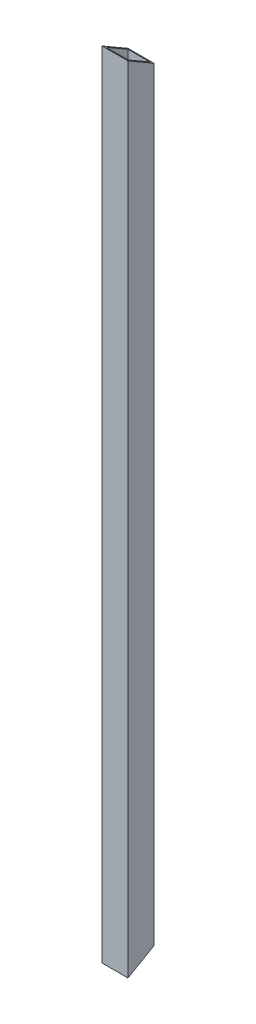
ISO-10303-21;
HEADER;
FILE_DESCRIPTION(('STEP AP214'),'2;1');
FILE_NAME('part.step','',(''),(''),'','','');
FILE_SCHEMA(('AUTOMOTIVE_DESIGN { 1 0 10303 214 1 1 1 1 }'));
ENDSEC;
DATA;
#1=APPLICATION_CONTEXT('core data for automotive mechanical design processes');
#2=APPLICATION_PROTOCOL_DEFINITION('international standard','automotive_design',2000,#1);
#3=PRODUCT_CONTEXT('',#1,'mechanical');
#4=PRODUCT('Part','Part','',(#3));
#5=PRODUCT_RELATED_PRODUCT_CATEGORY('part','',(#4));
#6=PRODUCT_DEFINITION_FORMATION('','',#4);
#7=PRODUCT_DEFINITION_CONTEXT('part definition',#1,'design');
#8=PRODUCT_DEFINITION('design','',#6,#7);
#9=PRODUCT_DEFINITION_SHAPE('','',#8);
#10=(LENGTH_UNIT() NAMED_UNIT(*) SI_UNIT(.MILLI.,.METRE.));
#11=(NAMED_UNIT(*) PLANE_ANGLE_UNIT() SI_UNIT($,.RADIAN.));
#12=(NAMED_UNIT(*) SI_UNIT($,.STERADIAN.) SOLID_ANGLE_UNIT());
#13=UNCERTAINTY_MEASURE_WITH_UNIT(LENGTH_MEASURE(1.E-05),#10,'distance_accuracy_value','');
#14=(GEOMETRIC_REPRESENTATION_CONTEXT(3) GLOBAL_UNCERTAINTY_ASSIGNED_CONTEXT((#13)) GLOBAL_UNIT_ASSIGNED_CONTEXT((#10,
#11,#12)) REPRESENTATION_CONTEXT('',''));
#15=CARTESIAN_POINT('',(0.,0.,0.));
#16=DIRECTION('',(0.,0.,1.));
#17=DIRECTION('',(1.,0.,0.));
#18=AXIS2_PLACEMENT_3D('',#15,#16,#17);
#19=CARTESIAN_POINT('',(-6.5,400.,-6.5));
#20=DIRECTION('',(1.,0.,0.));
#21=DIRECTION('',(0.,0.,-1.));
#22=AXIS2_PLACEMENT_3D('',#19,#20,#21);
#23=PLANE('',#22);
#24=DIRECTION('',(0.,0.499999999999995,-0.866025403784442));
#25=VECTOR('',#24,1.);
#26=CARTESIAN_POINT('',(-6.5,105.629165124597,-176.455080756887));
#27=LINE('',#26,#25);
#28=CARTESIAN_POINT('',(-6.5,0.,6.5));
#29=VERTEX_POINT('',#28);
#30=CARTESIAN_POINT('',(-6.5,7.50555349946508,-6.5));
#31=VERTEX_POINT('',#30);
#32=EDGE_CURVE('E121',#29,#31,#27,.T.);
#33=ORIENTED_EDGE('',*,*,#32,.F.);
#34=DIRECTION('',(0.,-1.,0.));
#35=VECTOR('',#34,1.);
#36=CARTESIAN_POINT('',(-6.5,400.,6.5));
#37=LINE('',#36,#35);
#38=CARTESIAN_POINT('',(-6.49999999999995,400.,6.5));
#39=VERTEX_POINT('',#38);
#40=EDGE_CURVE('E187',#39,#29,#37,.T.);
#41=ORIENTED_EDGE('',*,*,#40,.F.);
#42=DIRECTION('',(0.,-0.499999999999995,-0.866025403784442));
#43=VECTOR('',#42,1.);
#44=CARTESIAN_POINT('',(-6.5,394.370834875401,-3.25000000000007));
#45=LINE('',#44,#43);
#46=CARTESIAN_POINT('',(-6.49999999999995,392.494446500535,-6.5));
#47=VERTEX_POINT('',#46);
#48=EDGE_CURVE('E157',#39,#47,#45,.T.);
#49=ORIENTED_EDGE('',*,*,#48,.T.);
#50=DIRECTION('',(0.,-1.,0.));
#51=VECTOR('',#50,1.);
#52=CARTESIAN_POINT('',(-6.5,400.,-6.5));
#53=LINE('',#52,#51);
#54=EDGE_CURVE('E111',#47,#31,#53,.T.);
#55=ORIENTED_EDGE('',*,*,#54,.T.);
#56=EDGE_LOOP('',(#33,#41,#49,#55));
#57=FACE_BOUND('',#56,.T.);
#58=ADVANCED_FACE('F39',(#57),#23,.F.);
#59=CARTESIAN_POINT('',(6.5,400.,-6.5));
#60=DIRECTION('',(-1.,0.,0.));
#61=DIRECTION('',(0.,0.,1.));
#62=AXIS2_PLACEMENT_3D('',#59,#60,#61);
#63=PLANE('',#62);
#64=DIRECTION('',(0.,-0.499999999999994,0.866025403784442));
#65=VECTOR('',#64,1.);
#66=CARTESIAN_POINT('',(6.5,105.629165124597,-176.455080756887));
#67=LINE('',#66,#65);
#68=CARTESIAN_POINT('',(6.49999999999995,7.50555349946502,-6.5));
#69=VERTEX_POINT('',#68);
#70=CARTESIAN_POINT('',(6.5,0.,6.5));
#71=VERTEX_POINT('',#70);
#72=EDGE_CURVE('E115',#69,#71,#67,.T.);
#73=ORIENTED_EDGE('',*,*,#72,.F.);
#74=DIRECTION('',(0.,-1.,0.));
#75=VECTOR('',#74,1.);
#76=CARTESIAN_POINT('',(6.5,400.,-6.5));
#77=LINE('',#76,#75);
#78=CARTESIAN_POINT('',(6.5,392.494446500535,-6.5));
#79=VERTEX_POINT('',#78);
#80=EDGE_CURVE('E103',#79,#69,#77,.T.);
#81=ORIENTED_EDGE('',*,*,#80,.F.);
#82=DIRECTION('',(0.,0.499999999999994,0.866025403784442));
#83=VECTOR('',#82,1.);
#84=CARTESIAN_POINT('',(6.5,394.370834875401,-3.25000000000007));
#85=LINE('',#84,#83);
#86=CARTESIAN_POINT('',(6.49999999999995,400.,6.5));
#87=VERTEX_POINT('',#86);
#88=EDGE_CURVE('E154',#79,#87,#85,.T.);
#89=ORIENTED_EDGE('',*,*,#88,.T.);
#90=DIRECTION('',(0.,-1.,0.));
#91=VECTOR('',#90,1.);
#92=CARTESIAN_POINT('',(6.5,400.,6.5));
#93=LINE('',#92,#91);
#94=EDGE_CURVE('E110',#87,#71,#93,.T.);
#95=ORIENTED_EDGE('',*,*,#94,.T.);
#96=EDGE_LOOP('',(#73,#81,#89,#95));
#97=FACE_BOUND('',#96,.T.);
#98=ADVANCED_FACE('F116',(#97),#63,.F.);
#99=CARTESIAN_POINT('',(-6.5,400.,-6.5));
#100=DIRECTION('',(0.,0.,1.));
#101=DIRECTION('',(1.,0.,0.));
#102=AXIS2_PLACEMENT_3D('',#99,#100,#101);
#103=PLANE('',#102);
#104=DIRECTION('',(1.,0.,0.));
#105=VECTOR('',#104,1.);
#106=CARTESIAN_POINT('',(-507.027846378201,7.50555349946502,-6.5));
#107=LINE('',#106,#105);
#108=EDGE_CURVE('E54',#31,#69,#107,.T.);
#109=ORIENTED_EDGE('',*,*,#108,.F.);
#110=ORIENTED_EDGE('',*,*,#54,.F.);
#111=DIRECTION('',(1.,0.,0.));
#112=VECTOR('',#111,1.);
#113=CARTESIAN_POINT('',(-507.027846378201,392.494446500535,-6.5));
#114=LINE('',#113,#112);
#115=EDGE_CURVE('E106',#47,#79,#114,.T.);
#116=ORIENTED_EDGE('',*,*,#115,.T.);
#117=ORIENTED_EDGE('',*,*,#80,.T.);
#118=EDGE_LOOP('',(#109,#110,#116,#117));
#119=FACE_BOUND('',#118,.T.);
#120=ADVANCED_FACE('F105',(#119),#103,.F.);
#121=CARTESIAN_POINT('',(5.5,400.,-5.5));
#122=DIRECTION('',(-1.,0.,0.));
#123=DIRECTION('',(0.,0.,1.));
#124=AXIS2_PLACEMENT_3D('',#121,#122,#123);
#125=PLANE('',#124);
#126=DIRECTION('',(0.,-1.,0.));
#127=VECTOR('',#126,1.);
#128=CARTESIAN_POINT('',(5.5,400.,-5.5));
#129=LINE('',#128,#127);
#130=CARTESIAN_POINT('',(5.5,393.071796769725,-5.5));
#131=VERTEX_POINT('',#130);
#132=CARTESIAN_POINT('',(5.5,6.92820323027543,-5.5));
#133=VERTEX_POINT('',#132);
#134=EDGE_CURVE('E173',#131,#133,#129,.T.);
#135=ORIENTED_EDGE('',*,*,#134,.T.);
#136=DIRECTION('',(0.,-0.499999999999995,0.866025403784442));
#137=VECTOR('',#136,1.);
#138=CARTESIAN_POINT('',(5.49999999999997,105.196152422704,-175.705080756887));
#139=LINE('',#138,#137);
#140=CARTESIAN_POINT('',(5.5,0.577350269189647,5.5));
#141=VERTEX_POINT('',#140);
#142=EDGE_CURVE('E122',#133,#141,#139,.T.);
#143=ORIENTED_EDGE('',*,*,#142,.T.);
#144=DIRECTION('',(0.,-1.,0.));
#145=VECTOR('',#144,1.);
#146=CARTESIAN_POINT('',(5.5,400.,5.5));
#147=LINE('',#146,#145);
#148=CARTESIAN_POINT('',(5.5,399.42264973081,5.5));
#149=VERTEX_POINT('',#148);
#150=EDGE_CURVE('E161',#149,#141,#147,.T.);
#151=ORIENTED_EDGE('',*,*,#150,.F.);
#152=DIRECTION('',(0.,0.499999999999995,0.866025403784442));
#153=VECTOR('',#152,1.);
#154=CARTESIAN_POINT('',(5.5,394.803847577293,-2.50000000000007));
#155=LINE('',#154,#153);
#156=EDGE_CURVE('E150',#131,#149,#155,.T.);
#157=ORIENTED_EDGE('',*,*,#156,.F.);
#158=EDGE_LOOP('',(#135,#143,#151,#157));
#159=FACE_BOUND('',#158,.T.);
#160=ADVANCED_FACE('F200',(#159),#125,.T.);
#161=CARTESIAN_POINT('',(-5.5,400.,-5.5));
#162=DIRECTION('',(0.,0.,1.));
#163=DIRECTION('',(1.,0.,0.));
#164=AXIS2_PLACEMENT_3D('',#161,#162,#163);
#165=PLANE('',#164);
#166=DIRECTION('',(0.,-1.,0.));
#167=VECTOR('',#166,1.);
#168=CARTESIAN_POINT('',(-5.5,400.,-5.5));
#169=LINE('',#168,#167);
#170=CARTESIAN_POINT('',(-5.5,393.071796769725,-5.5));
#171=VERTEX_POINT('',#170);
#172=CARTESIAN_POINT('',(-5.5,6.92820323027539,-5.50000000000001));
#173=VERTEX_POINT('',#172);
#174=EDGE_CURVE('E169',#171,#173,#169,.T.);
#175=ORIENTED_EDGE('',*,*,#174,.T.);
#176=DIRECTION('',(1.,0.,0.));
#177=VECTOR('',#176,1.);
#178=CARTESIAN_POINT('',(-5.5,6.92820323027543,-5.5));
#179=LINE('',#178,#177);
#180=EDGE_CURVE('E129',#173,#133,#179,.T.);
#181=ORIENTED_EDGE('',*,*,#180,.T.);
#182=ORIENTED_EDGE('',*,*,#134,.F.);
#183=DIRECTION('',(1.,0.,0.));
#184=VECTOR('',#183,1.);
#185=CARTESIAN_POINT('',(-5.5,393.071796769725,-5.5));
#186=LINE('',#185,#184);
#187=EDGE_CURVE('E146',#171,#131,#186,.T.);
#188=ORIENTED_EDGE('',*,*,#187,.F.);
#189=EDGE_LOOP('',(#175,#181,#182,#188));
#190=FACE_BOUND('',#189,.T.);
#191=ADVANCED_FACE('F203',(#190),#165,.T.);
#192=CARTESIAN_POINT('',(-5.5,400.,-5.5));
#193=DIRECTION('',(1.,0.,0.));
#194=DIRECTION('',(0.,0.,-1.));
#195=AXIS2_PLACEMENT_3D('',#192,#193,#194);
#196=PLANE('',#195);
#197=DIRECTION('',(0.,-1.,0.));
#198=VECTOR('',#197,1.);
#199=CARTESIAN_POINT('',(-5.5,400.,5.5));
#200=LINE('',#199,#198);
#201=CARTESIAN_POINT('',(-5.5,399.42264973081,5.5));
#202=VERTEX_POINT('',#201);
#203=CARTESIAN_POINT('',(-5.5,0.577350269189647,5.5));
#204=VERTEX_POINT('',#203);
#205=EDGE_CURVE('E165',#202,#204,#200,.T.);
#206=ORIENTED_EDGE('',*,*,#205,.T.);
#207=DIRECTION('',(0.,0.499999999999995,-0.866025403784442));
#208=VECTOR('',#207,1.);
#209=CARTESIAN_POINT('',(-5.50000000000001,105.196152422704,-175.705080756887));
#210=LINE('',#209,#208);
#211=EDGE_CURVE('E62',#204,#173,#210,.T.);
#212=ORIENTED_EDGE('',*,*,#211,.T.);
#213=ORIENTED_EDGE('',*,*,#174,.F.);
#214=DIRECTION('',(0.,-0.499999999999995,-0.866025403784442));
#215=VECTOR('',#214,1.);
#216=CARTESIAN_POINT('',(-5.5,394.803847577293,-2.50000000000007));
#217=LINE('',#216,#215);
#218=EDGE_CURVE('E142',#202,#171,#217,.T.);
#219=ORIENTED_EDGE('',*,*,#218,.F.);
#220=EDGE_LOOP('',(#206,#212,#213,#219));
#221=FACE_BOUND('',#220,.T.);
#222=ADVANCED_FACE('F206',(#221),#196,.T.);
#223=CARTESIAN_POINT('',(-5.5,400.,5.5));
#224=DIRECTION('',(0.,0.,-1.));
#225=DIRECTION('',(-1.,0.,0.));
#226=AXIS2_PLACEMENT_3D('',#223,#224,#225);
#227=PLANE('',#226);
#228=ORIENTED_EDGE('',*,*,#150,.T.);
#229=DIRECTION('',(-1.,0.,0.));
#230=VECTOR('',#229,1.);
#231=CARTESIAN_POINT('',(-5.5,0.577350269189647,5.5));
#232=LINE('',#231,#230);
#233=EDGE_CURVE('E11',#141,#204,#232,.T.);
#234=ORIENTED_EDGE('',*,*,#233,.T.);
#235=ORIENTED_EDGE('',*,*,#205,.F.);
#236=DIRECTION('',(-1.,0.,0.));
#237=VECTOR('',#236,1.);
#238=CARTESIAN_POINT('',(-5.5,399.42264973081,5.5));
#239=LINE('',#238,#237);
#240=EDGE_CURVE('E47',#149,#202,#239,.T.);
#241=ORIENTED_EDGE('',*,*,#240,.F.);
#242=EDGE_LOOP('',(#228,#234,#235,#241));
#243=FACE_BOUND('',#242,.T.);
#244=ADVANCED_FACE('F198',(#243),#227,.T.);
#245=CARTESIAN_POINT('',(-6.5,400.,6.5));
#246=DIRECTION('',(0.,0.,-1.));
#247=DIRECTION('',(-1.,0.,0.));
#248=AXIS2_PLACEMENT_3D('',#245,#246,#247);
#249=PLANE('',#248);
#250=DIRECTION('',(1.,0.,0.));
#251=VECTOR('',#250,1.);
#252=CARTESIAN_POINT('',(-6.5,0.,6.5));
#253=LINE('',#252,#251);
#254=EDGE_CURVE('E177',#29,#71,#253,.T.);
#255=ORIENTED_EDGE('',*,*,#254,.T.);
#256=ORIENTED_EDGE('',*,*,#94,.F.);
#257=DIRECTION('',(1.,0.,0.));
#258=VECTOR('',#257,1.);
#259=CARTESIAN_POINT('',(-6.5,400.,6.5));
#260=LINE('',#259,#258);
#261=EDGE_CURVE('E178',#39,#87,#260,.T.);
#262=ORIENTED_EDGE('',*,*,#261,.F.);
#263=ORIENTED_EDGE('',*,*,#40,.T.);
#264=EDGE_LOOP('',(#255,#256,#262,#263));
#265=FACE_BOUND('',#264,.T.);
#266=ADVANCED_FACE('F213',(#265),#249,.F.);
#267=CARTESIAN_POINT('',(-507.027846378201,400.,6.5));
#268=DIRECTION('',(0.,-0.866025403784442,0.499999999999994));
#269=DIRECTION('',(0.,-0.499999999999995,-0.866025403784442));
#270=AXIS2_PLACEMENT_3D('',#267,#268,#269);
#271=PLANE('',#270);
#272=ORIENTED_EDGE('',*,*,#187,.T.);
#273=ORIENTED_EDGE('',*,*,#156,.T.);
#274=ORIENTED_EDGE('',*,*,#240,.T.);
#275=ORIENTED_EDGE('',*,*,#218,.T.);
#276=EDGE_LOOP('',(#272,#273,#274,#275));
#277=FACE_BOUND('',#276,.T.);
#278=ORIENTED_EDGE('',*,*,#48,.F.);
#279=ORIENTED_EDGE('',*,*,#261,.T.);
#280=ORIENTED_EDGE('',*,*,#88,.F.);
#281=ORIENTED_EDGE('',*,*,#115,.F.);
#282=EDGE_LOOP('',(#278,#279,#280,#281));
#283=FACE_BOUND('',#282,.T.);
#284=ADVANCED_FACE('F193',(#277,#283),#271,.F.);
#285=CARTESIAN_POINT('',(-507.027846378201,0.,6.5));
#286=DIRECTION('',(0.,-0.866025403784442,-0.499999999999994));
#287=DIRECTION('',(0.,0.499999999999995,-0.866025403784442));
#288=AXIS2_PLACEMENT_3D('',#285,#286,#287);
#289=PLANE('',#288);
#290=ORIENTED_EDGE('',*,*,#142,.F.);
#291=ORIENTED_EDGE('',*,*,#180,.F.);
#292=ORIENTED_EDGE('',*,*,#211,.F.);
#293=ORIENTED_EDGE('',*,*,#233,.F.);
#294=EDGE_LOOP('',(#290,#291,#292,#293));
#295=FACE_BOUND('',#294,.T.);
#296=ORIENTED_EDGE('',*,*,#254,.F.);
#297=ORIENTED_EDGE('',*,*,#32,.T.);
#298=ORIENTED_EDGE('',*,*,#108,.T.);
#299=ORIENTED_EDGE('',*,*,#72,.T.);
#300=EDGE_LOOP('',(#296,#297,#298,#299));
#301=FACE_BOUND('',#300,.T.);
#302=ADVANCED_FACE('F125',(#295,#301),#289,.T.);
#303=CLOSED_SHELL('',(#58,#98,#120,#160,#191,#222,#244,#266,#284,#302));
#304=MANIFOLD_SOLID_BREP('B2',#303);
#305=ADVANCED_BREP_SHAPE_REPRESENTATION('',(#18,#304),#14);
#306=SHAPE_DEFINITION_REPRESENTATION(#9,#305);
ENDSEC;
END-ISO-10303-21;
